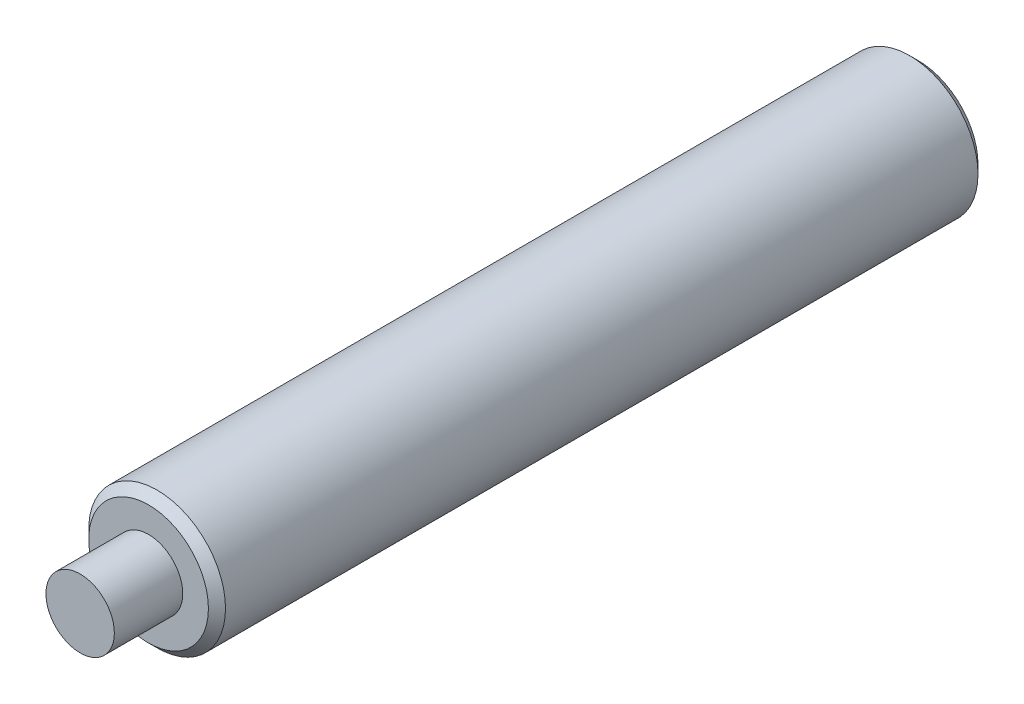
ISO-10303-21;
HEADER;
FILE_DESCRIPTION(('STEP AP214'),'2;1');
FILE_NAME('part.step','',(''),(''),'','','');
FILE_SCHEMA(('AUTOMOTIVE_DESIGN { 1 0 10303 214 1 1 1 1 }'));
ENDSEC;
DATA;
#1=APPLICATION_CONTEXT('core data for automotive mechanical design processes');
#2=APPLICATION_PROTOCOL_DEFINITION('international standard','automotive_design',2000,#1);
#3=PRODUCT_CONTEXT('',#1,'mechanical');
#4=PRODUCT('Part','Part','',(#3));
#5=PRODUCT_RELATED_PRODUCT_CATEGORY('part','',(#4));
#6=PRODUCT_DEFINITION_FORMATION('','',#4);
#7=PRODUCT_DEFINITION_CONTEXT('part definition',#1,'design');
#8=PRODUCT_DEFINITION('design','',#6,#7);
#9=PRODUCT_DEFINITION_SHAPE('','',#8);
#10=(LENGTH_UNIT() NAMED_UNIT(*) SI_UNIT(.MILLI.,.METRE.));
#11=(NAMED_UNIT(*) PLANE_ANGLE_UNIT() SI_UNIT($,.RADIAN.));
#12=(NAMED_UNIT(*) SI_UNIT($,.STERADIAN.) SOLID_ANGLE_UNIT());
#13=UNCERTAINTY_MEASURE_WITH_UNIT(LENGTH_MEASURE(1.E-05),#10,'distance_accuracy_value','');
#14=(GEOMETRIC_REPRESENTATION_CONTEXT(3) GLOBAL_UNCERTAINTY_ASSIGNED_CONTEXT((#13)) GLOBAL_UNIT_ASSIGNED_CONTEXT((#10,
#11,#12)) REPRESENTATION_CONTEXT('',''));
#15=CARTESIAN_POINT('',(0.,0.,0.));
#16=DIRECTION('',(0.,0.,1.));
#17=DIRECTION('',(1.,0.,0.));
#18=AXIS2_PLACEMENT_3D('',#15,#16,#17);
#19=CARTESIAN_POINT('',(0.,0.,45.));
#20=DIRECTION('',(0.,0.,1.));
#21=DIRECTION('',(1.,0.,0.));
#22=AXIS2_PLACEMENT_3D('',#19,#20,#21);
#23=PLANE('',#22);
#24=CARTESIAN_POINT('',(0.,0.,45.));
#25=DIRECTION('',(0.,0.,1.));
#26=DIRECTION('',(1.,0.,0.));
#27=AXIS2_PLACEMENT_3D('',#24,#25,#26);
#28=CIRCLE('',#27,3.49999999999999);
#29=CARTESIAN_POINT('',(3.49999999999999,0.,45.));
#30=VERTEX_POINT('',#29);
#31=EDGE_CURVE('E10',#30,#30,#28,.T.);
#32=ORIENTED_EDGE('',*,*,#31,.T.);
#33=EDGE_LOOP('',(#32));
#34=FACE_BOUND('',#33,.T.);
#35=CARTESIAN_POINT('',(0.,0.,45.));
#36=DIRECTION('',(0.,0.,1.));
#37=DIRECTION('',(1.,0.,0.));
#38=AXIS2_PLACEMENT_3D('',#35,#36,#37);
#39=CIRCLE('',#38,2.);
#40=CARTESIAN_POINT('',(2.,0.,45.));
#41=VERTEX_POINT('',#40);
#42=EDGE_CURVE('E55',#41,#41,#39,.T.);
#43=ORIENTED_EDGE('',*,*,#42,.F.);
#44=EDGE_LOOP('',(#43));
#45=FACE_BOUND('',#44,.T.);
#46=ADVANCED_FACE('F32',(#34,#45),#23,.T.);
#47=CARTESIAN_POINT('',(0.,0.,45.));
#48=DIRECTION('',(0.,0.,-1.));
#49=DIRECTION('',(-1.,0.,0.));
#50=AXIS2_PLACEMENT_3D('',#47,#48,#49);
#51=CYLINDRICAL_SURFACE('',#50,4.);
#52=CARTESIAN_POINT('',(0.,0.,0.5));
#53=DIRECTION('',(0.,0.,1.));
#54=DIRECTION('',(1.,0.,0.));
#55=AXIS2_PLACEMENT_3D('',#52,#53,#54);
#56=CIRCLE('',#55,4.);
#57=CARTESIAN_POINT('',(4.,0.,0.5));
#58=VERTEX_POINT('',#57);
#59=EDGE_CURVE('E43',#58,#58,#56,.T.);
#60=ORIENTED_EDGE('',*,*,#59,.T.);
#61=EDGE_LOOP('',(#60));
#62=FACE_BOUND('',#61,.T.);
#63=CARTESIAN_POINT('',(0.,0.,44.5));
#64=DIRECTION('',(0.,0.,1.));
#65=DIRECTION('',(1.,0.,0.));
#66=AXIS2_PLACEMENT_3D('',#63,#64,#65);
#67=CIRCLE('',#66,4.);
#68=CARTESIAN_POINT('',(4.,0.,44.5));
#69=VERTEX_POINT('',#68);
#70=EDGE_CURVE('E47',#69,#69,#67,.F.);
#71=ORIENTED_EDGE('',*,*,#70,.T.);
#72=EDGE_LOOP('',(#71));
#73=FACE_BOUND('',#72,.T.);
#74=ADVANCED_FACE('F34',(#62,#73),#51,.T.);
#75=CARTESIAN_POINT('',(0.,0.,0.));
#76=DIRECTION('',(0.,0.,1.));
#77=DIRECTION('',(1.,0.,0.));
#78=AXIS2_PLACEMENT_3D('',#75,#76,#77);
#79=PLANE('',#78);
#80=CARTESIAN_POINT('',(0.,0.,0.));
#81=DIRECTION('',(0.,0.,1.));
#82=DIRECTION('',(1.,0.,0.));
#83=AXIS2_PLACEMENT_3D('',#80,#81,#82);
#84=CIRCLE('',#83,3.49999999999999);
#85=CARTESIAN_POINT('',(3.49999999999999,0.,0.));
#86=VERTEX_POINT('',#85);
#87=EDGE_CURVE('E39',#86,#86,#84,.F.);
#88=ORIENTED_EDGE('',*,*,#87,.T.);
#89=EDGE_LOOP('',(#88));
#90=FACE_BOUND('',#89,.T.);
#91=ADVANCED_FACE('F65',(#90),#79,.F.);
#92=CARTESIAN_POINT('',(0.,0.,49.));
#93=DIRECTION('',(0.,0.,-1.));
#94=DIRECTION('',(-1.,0.,0.));
#95=AXIS2_PLACEMENT_3D('',#92,#93,#94);
#96=CYLINDRICAL_SURFACE('',#95,2.);
#97=CARTESIAN_POINT('',(0.,0.,49.));
#98=DIRECTION('',(0.,0.,1.));
#99=DIRECTION('',(1.,0.,0.));
#100=AXIS2_PLACEMENT_3D('',#97,#98,#99);
#101=CIRCLE('',#100,2.);
#102=CARTESIAN_POINT('',(2.,0.,49.));
#103=VERTEX_POINT('',#102);
#104=EDGE_CURVE('E52',#103,#103,#101,.T.);
#105=ORIENTED_EDGE('',*,*,#104,.F.);
#106=EDGE_LOOP('',(#105));
#107=FACE_BOUND('',#106,.T.);
#108=ORIENTED_EDGE('',*,*,#42,.T.);
#109=EDGE_LOOP('',(#108));
#110=FACE_BOUND('',#109,.T.);
#111=ADVANCED_FACE('F59',(#107,#110),#96,.T.);
#112=CARTESIAN_POINT('',(0.,0.,49.));
#113=DIRECTION('',(0.,0.,1.));
#114=DIRECTION('',(1.,0.,0.));
#115=AXIS2_PLACEMENT_3D('',#112,#113,#114);
#116=PLANE('',#115);
#117=ORIENTED_EDGE('',*,*,#104,.T.);
#118=EDGE_LOOP('',(#117));
#119=FACE_BOUND('',#118,.T.);
#120=ADVANCED_FACE('F72',(#119),#116,.T.);
#121=CARTESIAN_POINT('',(0.,0.,0.5));
#122=DIRECTION('',(0.,0.,1.));
#123=DIRECTION('',(1.,0.,0.));
#124=AXIS2_PLACEMENT_3D('',#121,#122,#123);
#125=CONICAL_SURFACE('',#124,4.,0.785398163397457);
#126=ORIENTED_EDGE('',*,*,#87,.F.);
#127=EDGE_LOOP('',(#126));
#128=FACE_BOUND('',#127,.T.);
#129=ORIENTED_EDGE('',*,*,#59,.F.);
#130=EDGE_LOOP('',(#129));
#131=FACE_BOUND('',#130,.T.);
#132=ADVANCED_FACE('F76',(#128,#131),#125,.T.);
#133=CARTESIAN_POINT('',(0.,0.,45.));
#134=DIRECTION('',(0.,0.,-1.));
#135=DIRECTION('',(-1.,0.,0.));
#136=AXIS2_PLACEMENT_3D('',#133,#134,#135);
#137=CONICAL_SURFACE('',#136,3.49999999999999,0.785398163397457);
#138=ORIENTED_EDGE('',*,*,#70,.F.);
#139=EDGE_LOOP('',(#138));
#140=FACE_BOUND('',#139,.T.);
#141=ORIENTED_EDGE('',*,*,#31,.F.);
#142=EDGE_LOOP('',(#141));
#143=FACE_BOUND('',#142,.T.);
#144=ADVANCED_FACE('F80',(#140,#143),#137,.T.);
#145=CLOSED_SHELL('',(#46,#74,#91,#111,#120,#132,#144));
#146=MANIFOLD_SOLID_BREP('B2',#145);
#147=ADVANCED_BREP_SHAPE_REPRESENTATION('',(#18,#146),#14);
#148=SHAPE_DEFINITION_REPRESENTATION(#9,#147);
ENDSEC;
END-ISO-10303-21;
